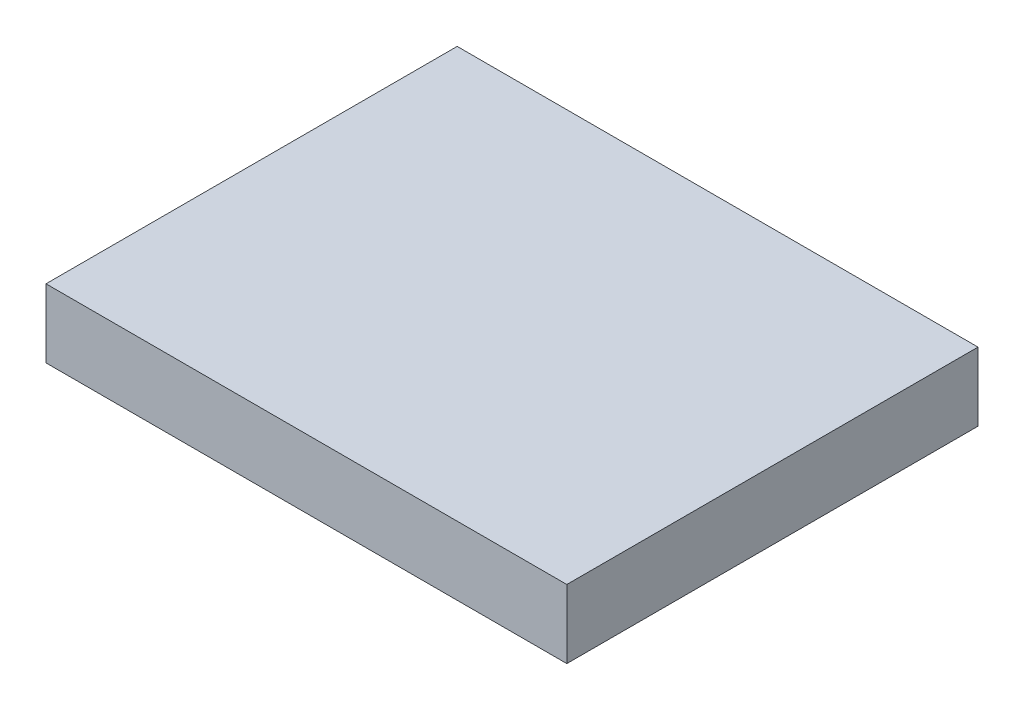
ISO-10303-21;
HEADER;
FILE_DESCRIPTION(('STEP AP214'),'2;1');
FILE_NAME('part.step','',(''),(''),'','','');
FILE_SCHEMA(('AUTOMOTIVE_DESIGN { 1 0 10303 214 1 1 1 1 }'));
ENDSEC;
DATA;
#1=APPLICATION_CONTEXT('core data for automotive mechanical design processes');
#2=APPLICATION_PROTOCOL_DEFINITION('international standard','automotive_design',2000,#1);
#3=PRODUCT_CONTEXT('',#1,'mechanical');
#4=PRODUCT('Part','Part','',(#3));
#5=PRODUCT_RELATED_PRODUCT_CATEGORY('part','',(#4));
#6=PRODUCT_DEFINITION_FORMATION('','',#4);
#7=PRODUCT_DEFINITION_CONTEXT('part definition',#1,'design');
#8=PRODUCT_DEFINITION('design','',#6,#7);
#9=PRODUCT_DEFINITION_SHAPE('','',#8);
#10=(LENGTH_UNIT() NAMED_UNIT(*) SI_UNIT(.MILLI.,.METRE.));
#11=(NAMED_UNIT(*) PLANE_ANGLE_UNIT() SI_UNIT($,.RADIAN.));
#12=(NAMED_UNIT(*) SI_UNIT($,.STERADIAN.) SOLID_ANGLE_UNIT());
#13=UNCERTAINTY_MEASURE_WITH_UNIT(LENGTH_MEASURE(1.E-05),#10,'distance_accuracy_value','');
#14=(GEOMETRIC_REPRESENTATION_CONTEXT(3) GLOBAL_UNCERTAINTY_ASSIGNED_CONTEXT((#13)) GLOBAL_UNIT_ASSIGNED_CONTEXT((#10,
#11,#12)) REPRESENTATION_CONTEXT('',''));
#15=CARTESIAN_POINT('',(0.,0.,0.));
#16=DIRECTION('',(0.,0.,1.));
#17=DIRECTION('',(1.,0.,0.));
#18=AXIS2_PLACEMENT_3D('',#15,#16,#17);
#19=CARTESIAN_POINT('',(-9.652,2.54,7.62));
#20=DIRECTION('',(1.,0.,0.));
#21=DIRECTION('',(0.,0.,-1.));
#22=AXIS2_PLACEMENT_3D('',#19,#20,#21);
#23=PLANE('',#22);
#24=DIRECTION('',(0.,0.,1.));
#25=VECTOR('',#24,1.);
#26=CARTESIAN_POINT('',(-9.652,0.,7.62));
#27=LINE('',#26,#25);
#28=CARTESIAN_POINT('',(-9.652,0.,-7.61999999999999));
#29=VERTEX_POINT('',#28);
#30=CARTESIAN_POINT('',(-9.652,0.,7.62));
#31=VERTEX_POINT('',#30);
#32=EDGE_CURVE('E94',#29,#31,#27,.T.);
#33=ORIENTED_EDGE('',*,*,#32,.T.);
#34=DIRECTION('',(0.,-1.,0.));
#35=VECTOR('',#34,1.);
#36=CARTESIAN_POINT('',(-9.652,2.54,7.62));
#37=LINE('',#36,#35);
#38=CARTESIAN_POINT('',(-9.652,2.54,7.62));
#39=VERTEX_POINT('',#38);
#40=EDGE_CURVE('E11',#39,#31,#37,.T.);
#41=ORIENTED_EDGE('',*,*,#40,.F.);
#42=DIRECTION('',(0.,0.,1.));
#43=VECTOR('',#42,1.);
#44=CARTESIAN_POINT('',(-9.652,2.54,7.62));
#45=LINE('',#44,#43);
#46=CARTESIAN_POINT('',(-9.652,2.54,-7.61999999999999));
#47=VERTEX_POINT('',#46);
#48=EDGE_CURVE('E82',#47,#39,#45,.T.);
#49=ORIENTED_EDGE('',*,*,#48,.F.);
#50=DIRECTION('',(0.,-1.,0.));
#51=VECTOR('',#50,1.);
#52=CARTESIAN_POINT('',(-9.652,2.54,-7.61999999999999));
#53=LINE('',#52,#51);
#54=EDGE_CURVE('E90',#47,#29,#53,.T.);
#55=ORIENTED_EDGE('',*,*,#54,.T.);
#56=EDGE_LOOP('',(#33,#41,#49,#55));
#57=FACE_BOUND('',#56,.T.);
#58=ADVANCED_FACE('F31',(#57),#23,.F.);
#59=CARTESIAN_POINT('',(9.652,2.54,7.62));
#60=DIRECTION('',(0.,0.,-1.));
#61=DIRECTION('',(-1.,0.,0.));
#62=AXIS2_PLACEMENT_3D('',#59,#60,#61);
#63=PLANE('',#62);
#64=DIRECTION('',(1.,0.,0.));
#65=VECTOR('',#64,1.);
#66=CARTESIAN_POINT('',(9.652,0.,7.62));
#67=LINE('',#66,#65);
#68=CARTESIAN_POINT('',(9.652,0.,7.62));
#69=VERTEX_POINT('',#68);
#70=EDGE_CURVE('E86',#31,#69,#67,.T.);
#71=ORIENTED_EDGE('',*,*,#70,.T.);
#72=DIRECTION('',(0.,-1.,0.));
#73=VECTOR('',#72,1.);
#74=CARTESIAN_POINT('',(9.652,2.54,7.62));
#75=LINE('',#74,#73);
#76=CARTESIAN_POINT('',(9.652,2.54,7.62));
#77=VERTEX_POINT('',#76);
#78=EDGE_CURVE('E39',#77,#69,#75,.T.);
#79=ORIENTED_EDGE('',*,*,#78,.F.);
#80=DIRECTION('',(1.,0.,0.));
#81=VECTOR('',#80,1.);
#82=CARTESIAN_POINT('',(9.652,2.54,7.62));
#83=LINE('',#82,#81);
#84=EDGE_CURVE('E77',#39,#77,#83,.T.);
#85=ORIENTED_EDGE('',*,*,#84,.F.);
#86=ORIENTED_EDGE('',*,*,#40,.T.);
#87=EDGE_LOOP('',(#71,#79,#85,#86));
#88=FACE_BOUND('',#87,.T.);
#89=ADVANCED_FACE('F85',(#88),#63,.F.);
#90=CARTESIAN_POINT('',(9.652,2.54,7.62));
#91=DIRECTION('',(-1.,0.,0.));
#92=DIRECTION('',(0.,0.,1.));
#93=AXIS2_PLACEMENT_3D('',#90,#91,#92);
#94=PLANE('',#93);
#95=DIRECTION('',(0.,0.,-1.));
#96=VECTOR('',#95,1.);
#97=CARTESIAN_POINT('',(9.652,0.,7.62));
#98=LINE('',#97,#96);
#99=CARTESIAN_POINT('',(9.652,0.,-7.62));
#100=VERTEX_POINT('',#99);
#101=EDGE_CURVE('E64',#69,#100,#98,.T.);
#102=ORIENTED_EDGE('',*,*,#101,.T.);
#103=DIRECTION('',(0.,-1.,0.));
#104=VECTOR('',#103,1.);
#105=CARTESIAN_POINT('',(9.652,2.54,-7.62));
#106=LINE('',#105,#104);
#107=CARTESIAN_POINT('',(9.652,2.54,-7.62));
#108=VERTEX_POINT('',#107);
#109=EDGE_CURVE('E87',#108,#100,#106,.T.);
#110=ORIENTED_EDGE('',*,*,#109,.F.);
#111=DIRECTION('',(0.,0.,-1.));
#112=VECTOR('',#111,1.);
#113=CARTESIAN_POINT('',(9.652,2.54,7.62));
#114=LINE('',#113,#112);
#115=EDGE_CURVE('E80',#77,#108,#114,.T.);
#116=ORIENTED_EDGE('',*,*,#115,.F.);
#117=ORIENTED_EDGE('',*,*,#78,.T.);
#118=EDGE_LOOP('',(#102,#110,#116,#117));
#119=FACE_BOUND('',#118,.T.);
#120=ADVANCED_FACE('F88',(#119),#94,.F.);
#121=CARTESIAN_POINT('',(9.652,2.54,-7.62));
#122=DIRECTION('',(0.,0.,1.));
#123=DIRECTION('',(1.,0.,0.));
#124=AXIS2_PLACEMENT_3D('',#121,#122,#123);
#125=PLANE('',#124);
#126=DIRECTION('',(-1.,0.,0.));
#127=VECTOR('',#126,1.);
#128=CARTESIAN_POINT('',(9.652,0.,-7.62));
#129=LINE('',#128,#127);
#130=EDGE_CURVE('E70',#100,#29,#129,.T.);
#131=ORIENTED_EDGE('',*,*,#130,.T.);
#132=ORIENTED_EDGE('',*,*,#54,.F.);
#133=DIRECTION('',(-1.,0.,0.));
#134=VECTOR('',#133,1.);
#135=CARTESIAN_POINT('',(9.652,2.54,-7.62));
#136=LINE('',#135,#134);
#137=EDGE_CURVE('E47',#108,#47,#136,.T.);
#138=ORIENTED_EDGE('',*,*,#137,.F.);
#139=ORIENTED_EDGE('',*,*,#109,.T.);
#140=EDGE_LOOP('',(#131,#132,#138,#139));
#141=FACE_BOUND('',#140,.T.);
#142=ADVANCED_FACE('F101',(#141),#125,.F.);
#143=CARTESIAN_POINT('',(-9.652,2.54,-7.61999999999999));
#144=DIRECTION('',(0.,1.,0.));
#145=DIRECTION('',(0.,0.,1.));
#146=AXIS2_PLACEMENT_3D('',#143,#144,#145);
#147=PLANE('',#146);
#148=ORIENTED_EDGE('',*,*,#48,.T.);
#149=ORIENTED_EDGE('',*,*,#84,.T.);
#150=ORIENTED_EDGE('',*,*,#115,.T.);
#151=ORIENTED_EDGE('',*,*,#137,.T.);
#152=EDGE_LOOP('',(#148,#149,#150,#151));
#153=FACE_BOUND('',#152,.T.);
#154=ADVANCED_FACE('F78',(#153),#147,.T.);
#155=CARTESIAN_POINT('',(-9.652,0.,-7.61999999999999));
#156=DIRECTION('',(0.,1.,0.));
#157=DIRECTION('',(0.,0.,1.));
#158=AXIS2_PLACEMENT_3D('',#155,#156,#157);
#159=PLANE('',#158);
#160=ORIENTED_EDGE('',*,*,#32,.F.);
#161=ORIENTED_EDGE('',*,*,#130,.F.);
#162=ORIENTED_EDGE('',*,*,#101,.F.);
#163=ORIENTED_EDGE('',*,*,#70,.F.);
#164=EDGE_LOOP('',(#160,#161,#162,#163));
#165=FACE_BOUND('',#164,.T.);
#166=ADVANCED_FACE('F104',(#165),#159,.F.);
#167=CLOSED_SHELL('',(#58,#89,#120,#142,#154,#166));
#168=MANIFOLD_SOLID_BREP('B2',#167);
#169=ADVANCED_BREP_SHAPE_REPRESENTATION('',(#18,#168),#14);
#170=SHAPE_DEFINITION_REPRESENTATION(#9,#169);
ENDSEC;
END-ISO-10303-21;
